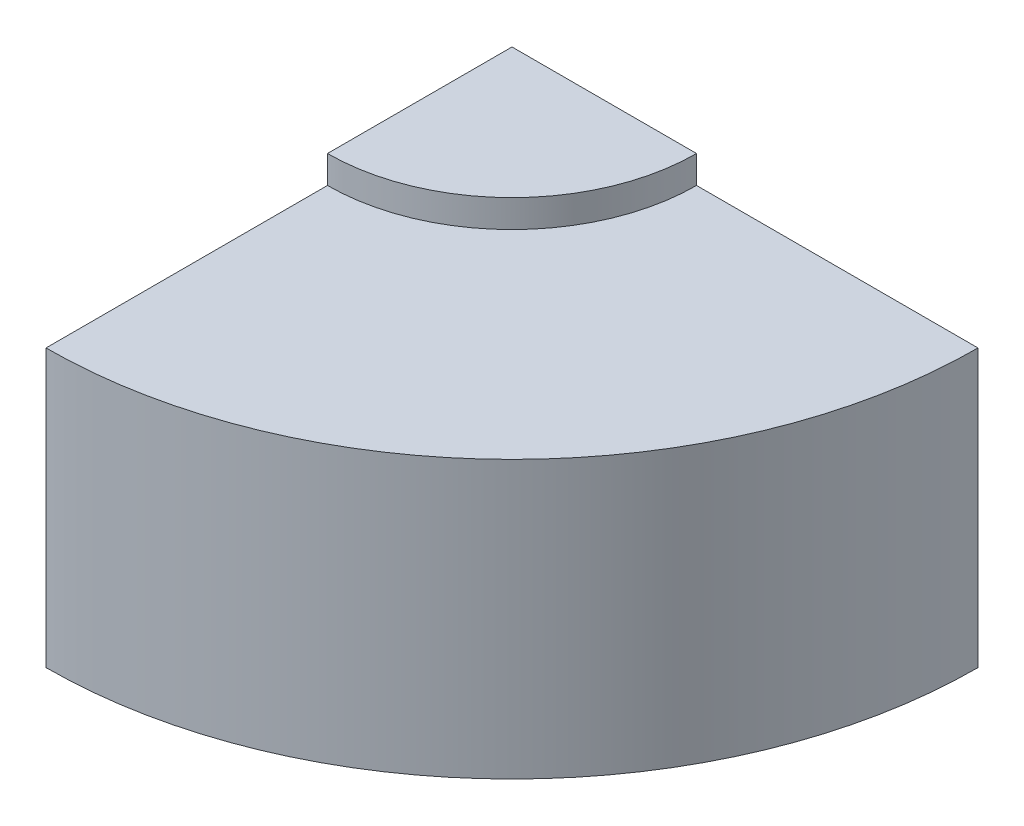
ISO-10303-21;
HEADER;
FILE_DESCRIPTION(('STEP AP214'),'2;1');
FILE_NAME('part.step','',(''),(''),'','','');
FILE_SCHEMA(('AUTOMOTIVE_DESIGN { 1 0 10303 214 1 1 1 1 }'));
ENDSEC;
DATA;
#1=APPLICATION_CONTEXT('core data for automotive mechanical design processes');
#2=APPLICATION_PROTOCOL_DEFINITION('international standard','automotive_design',2000,#1);
#3=PRODUCT_CONTEXT('',#1,'mechanical');
#4=PRODUCT('Part','Part','',(#3));
#5=PRODUCT_RELATED_PRODUCT_CATEGORY('part','',(#4));
#6=PRODUCT_DEFINITION_FORMATION('','',#4);
#7=PRODUCT_DEFINITION_CONTEXT('part definition',#1,'design');
#8=PRODUCT_DEFINITION('design','',#6,#7);
#9=PRODUCT_DEFINITION_SHAPE('','',#8);
#10=(LENGTH_UNIT() NAMED_UNIT(*) SI_UNIT(.MILLI.,.METRE.));
#11=(NAMED_UNIT(*) PLANE_ANGLE_UNIT() SI_UNIT($,.RADIAN.));
#12=(NAMED_UNIT(*) SI_UNIT($,.STERADIAN.) SOLID_ANGLE_UNIT());
#13=UNCERTAINTY_MEASURE_WITH_UNIT(LENGTH_MEASURE(1.E-05),#10,'distance_accuracy_value','');
#14=(GEOMETRIC_REPRESENTATION_CONTEXT(3) GLOBAL_UNCERTAINTY_ASSIGNED_CONTEXT((#13)) GLOBAL_UNIT_ASSIGNED_CONTEXT((#10,
#11,#12)) REPRESENTATION_CONTEXT('',''));
#15=CARTESIAN_POINT('',(0.,0.,0.));
#16=DIRECTION('',(0.,0.,1.));
#17=DIRECTION('',(1.,0.,0.));
#18=AXIS2_PLACEMENT_3D('',#15,#16,#17);
#19=CARTESIAN_POINT('',(0.,-31.839378238342,0.));
#20=DIRECTION('',(0.,1.,0.));
#21=DIRECTION('',(0.,0.,1.));
#22=AXIS2_PLACEMENT_3D('',#19,#20,#21);
#23=PLANE('',#22);
#24=DIRECTION('',(1.,0.,0.));
#25=VECTOR('',#24,1.);
#26=CARTESIAN_POINT('',(0.,-31.839378238342,0.));
#27=LINE('',#26,#25);
#28=CARTESIAN_POINT('',(20.,-31.839378238342,0.));
#29=VERTEX_POINT('',#28);
#30=CARTESIAN_POINT('',(101.,-31.839378238342,0.));
#31=VERTEX_POINT('',#30);
#32=EDGE_CURVE('E147',#29,#31,#27,.T.);
#33=ORIENTED_EDGE('',*,*,#32,.T.);
#34=CARTESIAN_POINT('',(0.,-31.839378238342,0.));
#35=DIRECTION('',(0.,1.,0.));
#36=DIRECTION('',(0.,0.,1.));
#37=AXIS2_PLACEMENT_3D('',#34,#35,#36);
#38=CIRCLE('',#37,101.);
#39=CARTESIAN_POINT('',(-3.52639615223157E-13,-31.839378238342,101.));
#40=VERTEX_POINT('',#39);
#41=EDGE_CURVE('E37',#40,#31,#38,.T.);
#42=ORIENTED_EDGE('',*,*,#41,.F.);
#43=DIRECTION('',(0.,0.,1.));
#44=VECTOR('',#43,1.);
#45=CARTESIAN_POINT('',(0.,-31.839378238342,0.));
#46=LINE('',#45,#44);
#47=CARTESIAN_POINT('',(0.,-31.839378238342,20.));
#48=VERTEX_POINT('',#47);
#49=EDGE_CURVE('E70',#48,#40,#46,.T.);
#50=ORIENTED_EDGE('',*,*,#49,.F.);
#51=CARTESIAN_POINT('',(0.,-31.839378238342,0.));
#52=DIRECTION('',(0.,1.,0.));
#53=DIRECTION('',(0.,0.,1.));
#54=AXIS2_PLACEMENT_3D('',#51,#52,#53);
#55=CIRCLE('',#54,20.);
#56=EDGE_CURVE('E11',#48,#29,#55,.T.);
#57=ORIENTED_EDGE('',*,*,#56,.T.);
#58=EDGE_LOOP('',(#33,#42,#50,#57));
#59=FACE_BOUND('',#58,.T.);
#60=ADVANCED_FACE('F33',(#59),#23,.F.);
#61=CARTESIAN_POINT('',(0.,34.160621761658,0.));
#62=DIRECTION('',(0.,1.,0.));
#63=DIRECTION('',(0.,0.,1.));
#64=AXIS2_PLACEMENT_3D('',#61,#62,#63);
#65=CYLINDRICAL_SURFACE('',#64,40.);
#66=CARTESIAN_POINT('',(0.,34.160621761658,0.));
#67=DIRECTION('',(0.,1.,0.));
#68=DIRECTION('',(0.,0.,1.));
#69=AXIS2_PLACEMENT_3D('',#66,#67,#68);
#70=CIRCLE('',#69,40.);
#71=CARTESIAN_POINT('',(-1.39659253553725E-13,34.160621761658,40.));
#72=VERTEX_POINT('',#71);
#73=CARTESIAN_POINT('',(40.,34.160621761658,0.));
#74=VERTEX_POINT('',#73);
#75=EDGE_CURVE('E118',#72,#74,#70,.T.);
#76=ORIENTED_EDGE('',*,*,#75,.F.);
#77=DIRECTION('',(0.,-1.,0.));
#78=VECTOR('',#77,1.);
#79=CARTESIAN_POINT('',(-1.39659253553725E-13,0.,40.));
#80=LINE('',#79,#78);
#81=CARTESIAN_POINT('',(-1.39659253553725E-13,28.160621761658,40.));
#82=VERTEX_POINT('',#81);
#83=EDGE_CURVE('E126',#72,#82,#80,.T.);
#84=ORIENTED_EDGE('',*,*,#83,.T.);
#85=CARTESIAN_POINT('',(0.,28.160621761658,0.));
#86=DIRECTION('',(0.,1.,0.));
#87=DIRECTION('',(0.,0.,1.));
#88=AXIS2_PLACEMENT_3D('',#85,#86,#87);
#89=CIRCLE('',#88,40.);
#90=CARTESIAN_POINT('',(40.,28.160621761658,0.));
#91=VERTEX_POINT('',#90);
#92=EDGE_CURVE('E43',#82,#91,#89,.T.);
#93=ORIENTED_EDGE('',*,*,#92,.T.);
#94=DIRECTION('',(0.,-1.,0.));
#95=VECTOR('',#94,1.);
#96=CARTESIAN_POINT('',(40.,0.,0.));
#97=LINE('',#96,#95);
#98=EDGE_CURVE('E120',#74,#91,#97,.T.);
#99=ORIENTED_EDGE('',*,*,#98,.F.);
#100=EDGE_LOOP('',(#76,#84,#93,#99));
#101=FACE_BOUND('',#100,.T.);
#102=ADVANCED_FACE('F168',(#101),#65,.T.);
#103=CARTESIAN_POINT('',(0.,34.160621761658,0.));
#104=DIRECTION('',(0.,1.,0.));
#105=DIRECTION('',(0.,0.,1.));
#106=AXIS2_PLACEMENT_3D('',#103,#104,#105);
#107=PLANE('',#106);
#108=DIRECTION('',(1.,0.,0.));
#109=VECTOR('',#108,1.);
#110=CARTESIAN_POINT('',(0.,34.160621761658,0.));
#111=LINE('',#110,#109);
#112=CARTESIAN_POINT('',(0.,34.160621761658,0.));
#113=VERTEX_POINT('',#112);
#114=EDGE_CURVE('E107',#113,#74,#111,.T.);
#115=ORIENTED_EDGE('',*,*,#114,.F.);
#116=DIRECTION('',(0.,0.,1.));
#117=VECTOR('',#116,1.);
#118=CARTESIAN_POINT('',(0.,34.160621761658,0.));
#119=LINE('',#118,#117);
#120=EDGE_CURVE('E113',#113,#72,#119,.T.);
#121=ORIENTED_EDGE('',*,*,#120,.T.);
#122=ORIENTED_EDGE('',*,*,#75,.T.);
#123=EDGE_LOOP('',(#115,#121,#122));
#124=FACE_BOUND('',#123,.T.);
#125=ADVANCED_FACE('F117',(#124),#107,.T.);
#126=CARTESIAN_POINT('',(0.,0.,0.));
#127=DIRECTION('',(-1.,0.,0.));
#128=DIRECTION('',(0.,0.,1.));
#129=AXIS2_PLACEMENT_3D('',#126,#127,#128);
#130=PLANE('',#129);
#131=ORIENTED_EDGE('',*,*,#49,.T.);
#132=DIRECTION('',(0.,1.,0.));
#133=VECTOR('',#132,1.);
#134=CARTESIAN_POINT('',(-3.52639615223157E-13,-31.839378238342,101.));
#135=LINE('',#134,#133);
#136=CARTESIAN_POINT('',(-3.52639615223157E-13,28.160621761658,101.));
#137=VERTEX_POINT('',#136);
#138=EDGE_CURVE('E140',#40,#137,#135,.T.);
#139=ORIENTED_EDGE('',*,*,#138,.T.);
#140=DIRECTION('',(0.,0.,-1.));
#141=VECTOR('',#140,1.);
#142=CARTESIAN_POINT('',(-3.52639615223157E-13,28.160621761658,101.));
#143=LINE('',#142,#141);
#144=EDGE_CURVE('E142',#137,#82,#143,.T.);
#145=ORIENTED_EDGE('',*,*,#144,.T.);
#146=ORIENTED_EDGE('',*,*,#83,.F.);
#147=ORIENTED_EDGE('',*,*,#120,.F.);
#148=DIRECTION('',(0.,-1.,0.));
#149=VECTOR('',#148,1.);
#150=CARTESIAN_POINT('',(0.,0.,0.));
#151=LINE('',#150,#149);
#152=CARTESIAN_POINT('',(0.,-41.839378238342,0.));
#153=VERTEX_POINT('',#152);
#154=EDGE_CURVE('E102',#113,#153,#151,.T.);
#155=ORIENTED_EDGE('',*,*,#154,.T.);
#156=DIRECTION('',(0.,0.,1.));
#157=VECTOR('',#156,1.);
#158=CARTESIAN_POINT('',(0.,-41.839378238342,0.));
#159=LINE('',#158,#157);
#160=CARTESIAN_POINT('',(0.,-41.839378238342,20.));
#161=VERTEX_POINT('',#160);
#162=EDGE_CURVE('E112',#153,#161,#159,.T.);
#163=ORIENTED_EDGE('',*,*,#162,.T.);
#164=DIRECTION('',(0.,-1.,0.));
#165=VECTOR('',#164,1.);
#166=CARTESIAN_POINT('',(0.,0.,20.));
#167=LINE('',#166,#165);
#168=EDGE_CURVE('E154',#48,#161,#167,.T.);
#169=ORIENTED_EDGE('',*,*,#168,.F.);
#170=EDGE_LOOP('',(#131,#139,#145,#146,#147,#155,#163,#169));
#171=FACE_BOUND('',#170,.T.);
#172=ADVANCED_FACE('F123',(#171),#130,.T.);
#173=CARTESIAN_POINT('',(0.,-41.839378238342,0.));
#174=DIRECTION('',(0.,1.,0.));
#175=DIRECTION('',(0.,0.,1.));
#176=AXIS2_PLACEMENT_3D('',#173,#174,#175);
#177=PLANE('',#176);
#178=ORIENTED_EDGE('',*,*,#162,.F.);
#179=DIRECTION('',(1.,0.,0.));
#180=VECTOR('',#179,1.);
#181=CARTESIAN_POINT('',(0.,-41.839378238342,0.));
#182=LINE('',#181,#180);
#183=CARTESIAN_POINT('',(20.,-41.839378238342,0.));
#184=VERTEX_POINT('',#183);
#185=EDGE_CURVE('E109',#153,#184,#182,.T.);
#186=ORIENTED_EDGE('',*,*,#185,.T.);
#187=CARTESIAN_POINT('',(0.,-41.839378238342,0.));
#188=DIRECTION('',(0.,1.,0.));
#189=DIRECTION('',(0.,0.,1.));
#190=AXIS2_PLACEMENT_3D('',#187,#188,#189);
#191=CIRCLE('',#190,20.);
#192=EDGE_CURVE('E52',#161,#184,#191,.T.);
#193=ORIENTED_EDGE('',*,*,#192,.F.);
#194=EDGE_LOOP('',(#178,#186,#193));
#195=FACE_BOUND('',#194,.T.);
#196=ADVANCED_FACE('F157',(#195),#177,.F.);
#197=CARTESIAN_POINT('',(0.,34.160621761658,0.));
#198=DIRECTION('',(0.,1.,0.));
#199=DIRECTION('',(0.,0.,1.));
#200=AXIS2_PLACEMENT_3D('',#197,#198,#199);
#201=CYLINDRICAL_SURFACE('',#200,20.);
#202=ORIENTED_EDGE('',*,*,#56,.F.);
#203=ORIENTED_EDGE('',*,*,#168,.T.);
#204=ORIENTED_EDGE('',*,*,#192,.T.);
#205=DIRECTION('',(0.,-1.,0.));
#206=VECTOR('',#205,1.);
#207=CARTESIAN_POINT('',(20.,0.,0.));
#208=LINE('',#207,#206);
#209=EDGE_CURVE('E146',#29,#184,#208,.T.);
#210=ORIENTED_EDGE('',*,*,#209,.F.);
#211=EDGE_LOOP('',(#202,#203,#204,#210));
#212=FACE_BOUND('',#211,.T.);
#213=ADVANCED_FACE('F156',(#212),#201,.T.);
#214=CARTESIAN_POINT('',(0.,0.,0.));
#215=DIRECTION('',(0.,0.,1.));
#216=DIRECTION('',(1.,0.,0.));
#217=AXIS2_PLACEMENT_3D('',#214,#215,#216);
#218=PLANE('',#217);
#219=DIRECTION('',(0.,1.,0.));
#220=VECTOR('',#219,1.);
#221=CARTESIAN_POINT('',(101.,-31.839378238342,0.));
#222=LINE('',#221,#220);
#223=CARTESIAN_POINT('',(101.,28.160621761658,0.));
#224=VERTEX_POINT('',#223);
#225=EDGE_CURVE('E135',#31,#224,#222,.T.);
#226=ORIENTED_EDGE('',*,*,#225,.F.);
#227=ORIENTED_EDGE('',*,*,#32,.F.);
#228=ORIENTED_EDGE('',*,*,#209,.T.);
#229=ORIENTED_EDGE('',*,*,#185,.F.);
#230=ORIENTED_EDGE('',*,*,#154,.F.);
#231=ORIENTED_EDGE('',*,*,#114,.T.);
#232=ORIENTED_EDGE('',*,*,#98,.T.);
#233=DIRECTION('',(-1.,0.,0.));
#234=VECTOR('',#233,1.);
#235=CARTESIAN_POINT('',(101.,28.160621761658,0.));
#236=LINE('',#235,#234);
#237=EDGE_CURVE('E137',#224,#91,#236,.T.);
#238=ORIENTED_EDGE('',*,*,#237,.F.);
#239=EDGE_LOOP('',(#226,#227,#228,#229,#230,#231,#232,#238));
#240=FACE_BOUND('',#239,.T.);
#241=ADVANCED_FACE('F105',(#240),#218,.F.);
#242=CARTESIAN_POINT('',(0.,34.160621761658,0.));
#243=DIRECTION('',(0.,1.,0.));
#244=DIRECTION('',(0.,0.,1.));
#245=AXIS2_PLACEMENT_3D('',#242,#243,#244);
#246=CYLINDRICAL_SURFACE('',#245,101.);
#247=CARTESIAN_POINT('',(0.,28.160621761658,0.));
#248=DIRECTION('',(0.,1.,0.));
#249=DIRECTION('',(0.,0.,1.));
#250=AXIS2_PLACEMENT_3D('',#247,#248,#249);
#251=CIRCLE('',#250,101.);
#252=EDGE_CURVE('E77',#137,#224,#251,.T.);
#253=ORIENTED_EDGE('',*,*,#252,.F.);
#254=ORIENTED_EDGE('',*,*,#138,.F.);
#255=ORIENTED_EDGE('',*,*,#41,.T.);
#256=ORIENTED_EDGE('',*,*,#225,.T.);
#257=EDGE_LOOP('',(#253,#254,#255,#256));
#258=FACE_BOUND('',#257,.T.);
#259=ADVANCED_FACE('F35',(#258),#246,.T.);
#260=CARTESIAN_POINT('',(-3.52639615223157E-13,28.160621761658,101.));
#261=DIRECTION('',(0.,-1.,0.));
#262=DIRECTION('',(0.,0.,-1.));
#263=AXIS2_PLACEMENT_3D('',#260,#261,#262);
#264=PLANE('',#263);
#265=ORIENTED_EDGE('',*,*,#92,.F.);
#266=ORIENTED_EDGE('',*,*,#144,.F.);
#267=ORIENTED_EDGE('',*,*,#252,.T.);
#268=ORIENTED_EDGE('',*,*,#237,.T.);
#269=EDGE_LOOP('',(#265,#266,#267,#268));
#270=FACE_BOUND('',#269,.T.);
#271=ADVANCED_FACE('F175',(#270),#264,.F.);
#272=CLOSED_SHELL('',(#60,#102,#125,#172,#196,#213,#241,#259,#271));
#273=MANIFOLD_SOLID_BREP('B2',#272);
#274=ADVANCED_BREP_SHAPE_REPRESENTATION('',(#18,#273),#14);
#275=SHAPE_DEFINITION_REPRESENTATION(#9,#274);
ENDSEC;
END-ISO-10303-21;
